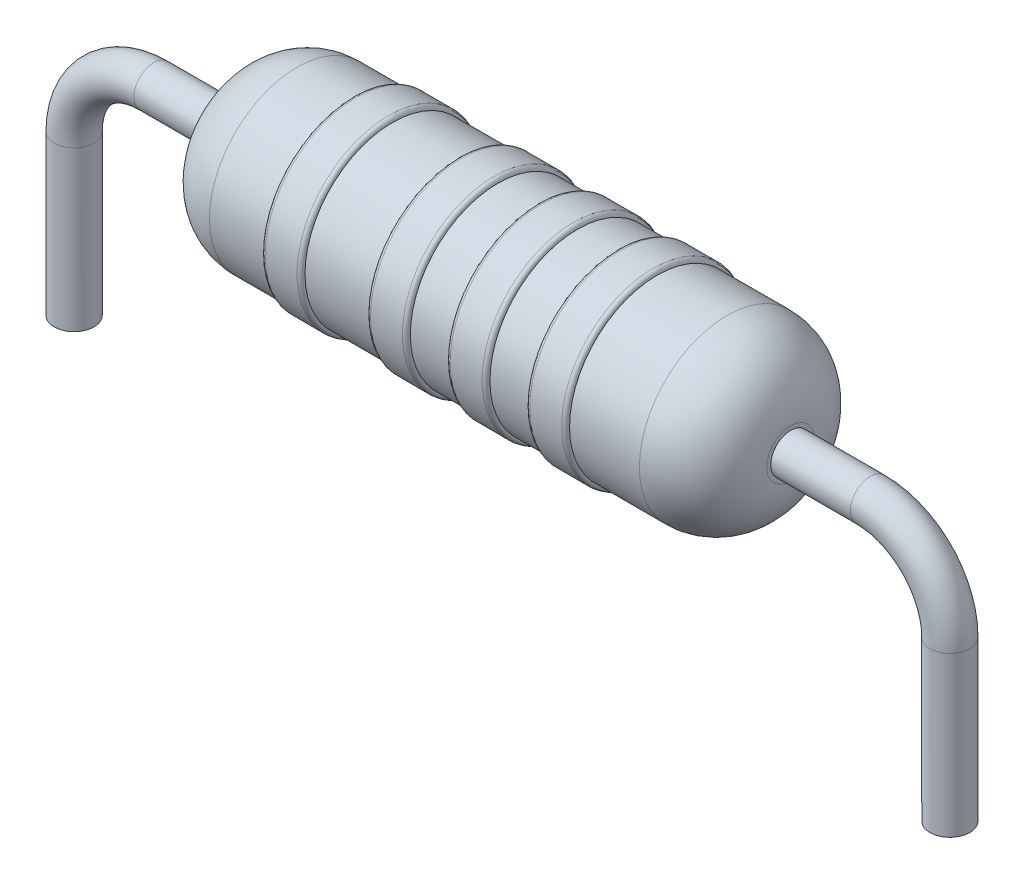
ISO-10303-21;
HEADER;
FILE_DESCRIPTION(('STEP AP214'),'2;1');
FILE_NAME('part.step','',(''),(''),'','','');
FILE_SCHEMA(('AUTOMOTIVE_DESIGN { 1 0 10303 214 1 1 1 1 }'));
ENDSEC;
DATA;
#1=APPLICATION_CONTEXT('core data for automotive mechanical design processes');
#2=APPLICATION_PROTOCOL_DEFINITION('international standard','automotive_design',2000,#1);
#3=PRODUCT_CONTEXT('',#1,'mechanical');
#4=PRODUCT('Part','Part','',(#3));
#5=PRODUCT_RELATED_PRODUCT_CATEGORY('part','',(#4));
#6=PRODUCT_DEFINITION_FORMATION('','',#4);
#7=PRODUCT_DEFINITION_CONTEXT('part definition',#1,'design');
#8=PRODUCT_DEFINITION('design','',#6,#7);
#9=PRODUCT_DEFINITION_SHAPE('','',#8);
#10=(LENGTH_UNIT() NAMED_UNIT(*) SI_UNIT(.MILLI.,.METRE.));
#11=(NAMED_UNIT(*) PLANE_ANGLE_UNIT() SI_UNIT($,.RADIAN.));
#12=(NAMED_UNIT(*) SI_UNIT($,.STERADIAN.) SOLID_ANGLE_UNIT());
#13=UNCERTAINTY_MEASURE_WITH_UNIT(LENGTH_MEASURE(1.E-05),#10,'distance_accuracy_value','');
#14=(GEOMETRIC_REPRESENTATION_CONTEXT(3) GLOBAL_UNCERTAINTY_ASSIGNED_CONTEXT((#13)) GLOBAL_UNIT_ASSIGNED_CONTEXT((#10,
#11,#12)) REPRESENTATION_CONTEXT('',''));
#15=CARTESIAN_POINT('',(0.,0.,0.));
#16=DIRECTION('',(0.,0.,1.));
#17=DIRECTION('',(1.,0.,0.));
#18=AXIS2_PLACEMENT_3D('',#15,#16,#17);
#19=CARTESIAN_POINT('',(-3.5,0.,0.));
#20=DIRECTION('',(1.,0.,0.));
#21=DIRECTION('',(0.,0.,-1.));
#22=AXIS2_PLACEMENT_3D('',#19,#20,#21);
#23=PLANE('',#22);
#24=CARTESIAN_POINT('',(-3.5,0.,0.));
#25=DIRECTION('',(-1.,0.,0.));
#26=DIRECTION('',(0.,0.,1.));
#27=AXIS2_PLACEMENT_3D('',#24,#25,#26);
#28=CIRCLE('',#27,0.299999999999995);
#29=CARTESIAN_POINT('',(-3.5,0.,0.299999999999995));
#30=VERTEX_POINT('',#29);
#31=EDGE_CURVE('E91',#30,#30,#28,.T.);
#32=ORIENTED_EDGE('',*,*,#31,.T.);
#33=EDGE_LOOP('',(#32));
#34=FACE_BOUND('',#33,.T.);
#35=CARTESIAN_POINT('',(-3.5,0.,0.));
#36=DIRECTION('',(1.,0.,0.));
#37=DIRECTION('',(0.,0.,-1.));
#38=AXIS2_PLACEMENT_3D('',#35,#36,#37);
#39=CIRCLE('',#38,0.25);
#40=CARTESIAN_POINT('',(-3.5,0.,-0.25));
#41=VERTEX_POINT('',#40);
#42=EDGE_CURVE('E10',#41,#41,#39,.F.);
#43=ORIENTED_EDGE('',*,*,#42,.F.);
#44=EDGE_LOOP('',(#43));
#45=FACE_BOUND('',#44,.T.);
#46=ADVANCED_FACE('F32',(#34,#45),#23,.F.);
#47=CARTESIAN_POINT('',(-54.2686615886834,0.,0.));
#48=DIRECTION('',(-1.,0.,0.));
#49=DIRECTION('',(0.,0.,1.));
#50=AXIS2_PLACEMENT_3D('',#47,#48,#49);
#51=CYLINDRICAL_SURFACE('',#50,1.1);
#52=CARTESIAN_POINT('',(0.322975145638588,0.,0.));
#53=DIRECTION('',(-1.,0.,0.));
#54=DIRECTION('',(0.,0.,1.));
#55=AXIS2_PLACEMENT_3D('',#52,#53,#54);
#56=CIRCLE('',#55,1.1);
#57=CARTESIAN_POINT('',(0.322975145638588,0.,1.1));
#58=VERTEX_POINT('',#57);
#59=EDGE_CURVE('E79',#58,#58,#56,.T.);
#60=ORIENTED_EDGE('',*,*,#59,.T.);
#61=EDGE_LOOP('',(#60));
#62=FACE_BOUND('',#61,.T.);
#63=CARTESIAN_POINT('',(-0.177024854361413,0.,0.));
#64=DIRECTION('',(1.,0.,0.));
#65=DIRECTION('',(0.,0.,-1.));
#66=AXIS2_PLACEMENT_3D('',#63,#64,#65);
#67=CIRCLE('',#66,1.1);
#68=CARTESIAN_POINT('',(-0.177024854361413,0.,-1.1));
#69=VERTEX_POINT('',#68);
#70=EDGE_CURVE('E88',#69,#69,#67,.T.);
#71=ORIENTED_EDGE('',*,*,#70,.T.);
#72=EDGE_LOOP('',(#71));
#73=FACE_BOUND('',#72,.T.);
#74=ADVANCED_FACE('F149',(#62,#73),#51,.T.);
#75=CARTESIAN_POINT('',(4.3261723446646,0.,0.));
#76=DIRECTION('',(1.,0.,0.));
#77=DIRECTION('',(0.,0.,-1.));
#78=AXIS2_PLACEMENT_3D('',#75,#76,#77);
#79=CYLINDRICAL_SURFACE('',#78,1.15);
#80=CARTESIAN_POINT('',(-0.627024854361413,0.,0.));
#81=DIRECTION('',(-1.,0.,0.));
#82=DIRECTION('',(0.,0.,1.));
#83=AXIS2_PLACEMENT_3D('',#80,#81,#82);
#84=CIRCLE('',#83,1.15);
#85=CARTESIAN_POINT('',(-0.627024854361413,0.,1.15));
#86=VERTEX_POINT('',#85);
#87=EDGE_CURVE('E55',#86,#86,#84,.F.);
#88=ORIENTED_EDGE('',*,*,#87,.T.);
#89=EDGE_LOOP('',(#88));
#90=FACE_BOUND('',#89,.T.);
#91=CARTESIAN_POINT('',(-0.227024854361413,0.,0.));
#92=DIRECTION('',(1.,0.,0.));
#93=DIRECTION('',(0.,0.,-1.));
#94=AXIS2_PLACEMENT_3D('',#91,#92,#93);
#95=CIRCLE('',#94,1.15);
#96=CARTESIAN_POINT('',(-0.227024854361413,0.,-1.15));
#97=VERTEX_POINT('',#96);
#98=EDGE_CURVE('E58',#97,#97,#95,.F.);
#99=ORIENTED_EDGE('',*,*,#98,.T.);
#100=EDGE_LOOP('',(#99));
#101=FACE_BOUND('',#100,.T.);
#102=ADVANCED_FACE('F155',(#90,#101),#79,.T.);
#103=CARTESIAN_POINT('',(-1.5,0.,0.));
#104=DIRECTION('',(1.,0.,0.));
#105=DIRECTION('',(0.,0.,-1.));
#106=AXIS2_PLACEMENT_3D('',#103,#104,#105);
#107=CIRCLE('',#106,1.1);
#108=CARTESIAN_POINT('',(-1.5,0.,-1.1));
#109=VERTEX_POINT('',#108);
#110=EDGE_CURVE('E72',#109,#109,#107,.T.);
#111=ORIENTED_EDGE('',*,*,#110,.T.);
#112=EDGE_LOOP('',(#111));
#113=FACE_BOUND('',#112,.T.);
#114=CARTESIAN_POINT('',(-0.677024854361413,0.,0.));
#115=DIRECTION('',(-1.,0.,0.));
#116=DIRECTION('',(0.,0.,1.));
#117=AXIS2_PLACEMENT_3D('',#114,#115,#116);
#118=CIRCLE('',#117,1.1);
#119=CARTESIAN_POINT('',(-0.677024854361413,0.,1.1));
#120=VERTEX_POINT('',#119);
#121=EDGE_CURVE('E85',#120,#120,#118,.T.);
#122=ORIENTED_EDGE('',*,*,#121,.T.);
#123=EDGE_LOOP('',(#122));
#124=FACE_BOUND('',#123,.T.);
#125=ADVANCED_FACE('F158',(#113,#124),#51,.T.);
#126=CARTESIAN_POINT('',(4.3261723446646,0.,0.));
#127=DIRECTION('',(1.,0.,0.));
#128=DIRECTION('',(0.,0.,-1.));
#129=AXIS2_PLACEMENT_3D('',#126,#127,#128);
#130=CYLINDRICAL_SURFACE('',#129,1.15);
#131=CARTESIAN_POINT('',(0.372975145638587,0.,0.));
#132=DIRECTION('',(-1.,0.,0.));
#133=DIRECTION('',(0.,0.,1.));
#134=AXIS2_PLACEMENT_3D('',#131,#132,#133);
#135=CIRCLE('',#134,1.15);
#136=CARTESIAN_POINT('',(0.372975145638587,0.,1.15));
#137=VERTEX_POINT('',#136);
#138=EDGE_CURVE('E47',#137,#137,#135,.F.);
#139=ORIENTED_EDGE('',*,*,#138,.T.);
#140=EDGE_LOOP('',(#139));
#141=FACE_BOUND('',#140,.T.);
#142=CARTESIAN_POINT('',(0.772975145638587,0.,0.));
#143=DIRECTION('',(1.,0.,0.));
#144=DIRECTION('',(0.,0.,-1.));
#145=AXIS2_PLACEMENT_3D('',#142,#143,#144);
#146=CIRCLE('',#145,1.15);
#147=CARTESIAN_POINT('',(0.772975145638587,0.,-1.15));
#148=VERTEX_POINT('',#147);
#149=EDGE_CURVE('E52',#148,#148,#146,.F.);
#150=ORIENTED_EDGE('',*,*,#149,.T.);
#151=EDGE_LOOP('',(#150));
#152=FACE_BOUND('',#151,.T.);
#153=ADVANCED_FACE('F171',(#141,#152),#130,.T.);
#154=CARTESIAN_POINT('',(1.32297514563859,0.,0.));
#155=DIRECTION('',(-1.,0.,0.));
#156=DIRECTION('',(0.,0.,1.));
#157=AXIS2_PLACEMENT_3D('',#154,#155,#156);
#158=CIRCLE('',#157,1.1);
#159=CARTESIAN_POINT('',(1.32297514563859,0.,1.1));
#160=VERTEX_POINT('',#159);
#161=EDGE_CURVE('E71',#160,#160,#158,.T.);
#162=ORIENTED_EDGE('',*,*,#161,.T.);
#163=EDGE_LOOP('',(#162));
#164=FACE_BOUND('',#163,.T.);
#165=CARTESIAN_POINT('',(0.822975145638588,0.,0.));
#166=DIRECTION('',(1.,0.,0.));
#167=DIRECTION('',(0.,0.,-1.));
#168=AXIS2_PLACEMENT_3D('',#165,#166,#167);
#169=CIRCLE('',#168,1.1);
#170=CARTESIAN_POINT('',(0.822975145638588,0.,-1.1));
#171=VERTEX_POINT('',#170);
#172=EDGE_CURVE('E82',#171,#171,#169,.T.);
#173=ORIENTED_EDGE('',*,*,#172,.T.);
#174=EDGE_LOOP('',(#173));
#175=FACE_BOUND('',#174,.T.);
#176=ADVANCED_FACE('F159',(#164,#175),#51,.T.);
#177=CARTESIAN_POINT('',(4.3261723446646,0.,0.));
#178=DIRECTION('',(1.,0.,0.));
#179=DIRECTION('',(0.,0.,-1.));
#180=AXIS2_PLACEMENT_3D('',#177,#178,#179);
#181=CYLINDRICAL_SURFACE('',#180,1.15);
#182=CARTESIAN_POINT('',(1.37297514563859,0.,0.));
#183=DIRECTION('',(-1.,0.,0.));
#184=DIRECTION('',(0.,0.,1.));
#185=AXIS2_PLACEMENT_3D('',#182,#183,#184);
#186=CIRCLE('',#185,1.15);
#187=CARTESIAN_POINT('',(1.37297514563859,0.,1.15));
#188=VERTEX_POINT('',#187);
#189=EDGE_CURVE('E39',#188,#188,#186,.F.);
#190=ORIENTED_EDGE('',*,*,#189,.T.);
#191=EDGE_LOOP('',(#190));
#192=FACE_BOUND('',#191,.T.);
#193=CARTESIAN_POINT('',(1.77297514563859,0.,0.));
#194=DIRECTION('',(1.,0.,0.));
#195=DIRECTION('',(0.,0.,-1.));
#196=AXIS2_PLACEMENT_3D('',#193,#194,#195);
#197=CIRCLE('',#196,1.15);
#198=CARTESIAN_POINT('',(1.77297514563859,0.,-1.15));
#199=VERTEX_POINT('',#198);
#200=EDGE_CURVE('E43',#199,#199,#197,.F.);
#201=ORIENTED_EDGE('',*,*,#200,.T.);
#202=EDGE_LOOP('',(#201));
#203=FACE_BOUND('',#202,.T.);
#204=ADVANCED_FACE('F181',(#192,#203),#181,.T.);
#205=CARTESIAN_POINT('',(3.5,0.299999999999995,0.));
#206=DIRECTION('',(-1.,0.,0.));
#207=DIRECTION('',(0.,0.,1.));
#208=AXIS2_PLACEMENT_3D('',#205,#206,#207);
#209=PLANE('',#208);
#210=CARTESIAN_POINT('',(3.5,0.,0.));
#211=DIRECTION('',(-1.,0.,0.));
#212=DIRECTION('',(0.,0.,1.));
#213=AXIS2_PLACEMENT_3D('',#210,#211,#212);
#214=CIRCLE('',#213,0.25);
#215=CARTESIAN_POINT('',(3.5,0.,0.25));
#216=VERTEX_POINT('',#215);
#217=EDGE_CURVE('E119',#216,#216,#214,.T.);
#218=ORIENTED_EDGE('',*,*,#217,.T.);
#219=EDGE_LOOP('',(#218));
#220=FACE_BOUND('',#219,.T.);
#221=CARTESIAN_POINT('',(3.5,0.,0.));
#222=DIRECTION('',(-1.,0.,0.));
#223=DIRECTION('',(0.,0.,1.));
#224=AXIS2_PLACEMENT_3D('',#221,#222,#223);
#225=CIRCLE('',#224,0.299999999999995);
#226=CARTESIAN_POINT('',(3.5,0.,0.299999999999995));
#227=VERTEX_POINT('',#226);
#228=EDGE_CURVE('E67',#227,#227,#225,.T.);
#229=ORIENTED_EDGE('',*,*,#228,.F.);
#230=EDGE_LOOP('',(#229));
#231=FACE_BOUND('',#230,.T.);
#232=ADVANCED_FACE('F177',(#220,#231),#209,.F.);
#233=CARTESIAN_POINT('',(2.7,0.,0.));
#234=DIRECTION('',(-1.,0.,0.));
#235=DIRECTION('',(0.,0.,1.));
#236=AXIS2_PLACEMENT_3D('',#233,#234,#235);
#237=DEGENERATE_TOROIDAL_SURFACE('',#236,0.3,0.8,.T.);
#238=CARTESIAN_POINT('',(2.69999999999999,0.,0.));
#239=DIRECTION('',(-1.,0.,0.));
#240=DIRECTION('',(0.,0.,1.));
#241=AXIS2_PLACEMENT_3D('',#238,#239,#240);
#242=CIRCLE('',#241,1.1);
#243=CARTESIAN_POINT('',(2.69999999999999,0.,1.1));
#244=VERTEX_POINT('',#243);
#245=EDGE_CURVE('E96',#244,#244,#242,.T.);
#246=ORIENTED_EDGE('',*,*,#245,.F.);
#247=EDGE_LOOP('',(#246));
#248=FACE_BOUND('',#247,.T.);
#249=ORIENTED_EDGE('',*,*,#228,.T.);
#250=EDGE_LOOP('',(#249));
#251=FACE_BOUND('',#250,.T.);
#252=ADVANCED_FACE('F173',(#248,#251),#237,.T.);
#253=CARTESIAN_POINT('',(1.82297514563859,0.,0.));
#254=DIRECTION('',(1.,0.,0.));
#255=DIRECTION('',(0.,0.,-1.));
#256=AXIS2_PLACEMENT_3D('',#253,#254,#255);
#257=CIRCLE('',#256,1.1);
#258=CARTESIAN_POINT('',(1.82297514563859,0.,-1.1));
#259=VERTEX_POINT('',#258);
#260=EDGE_CURVE('E76',#259,#259,#257,.T.);
#261=ORIENTED_EDGE('',*,*,#260,.T.);
#262=EDGE_LOOP('',(#261));
#263=FACE_BOUND('',#262,.T.);
#264=ORIENTED_EDGE('',*,*,#245,.T.);
#265=EDGE_LOOP('',(#264));
#266=FACE_BOUND('',#265,.T.);
#267=ADVANCED_FACE('F176',(#263,#266),#51,.T.);
#268=CARTESIAN_POINT('',(4.3261723446646,0.,0.));
#269=DIRECTION('',(1.,0.,0.));
#270=DIRECTION('',(0.,0.,-1.));
#271=AXIS2_PLACEMENT_3D('',#268,#269,#270);
#272=CYLINDRICAL_SURFACE('',#271,1.15);
#273=CARTESIAN_POINT('',(-1.95,0.,0.));
#274=DIRECTION('',(-1.,0.,0.));
#275=DIRECTION('',(0.,0.,1.));
#276=AXIS2_PLACEMENT_3D('',#273,#274,#275);
#277=CIRCLE('',#276,1.15);
#278=CARTESIAN_POINT('',(-1.95,0.,1.15));
#279=VERTEX_POINT('',#278);
#280=EDGE_CURVE('E61',#279,#279,#277,.F.);
#281=ORIENTED_EDGE('',*,*,#280,.T.);
#282=EDGE_LOOP('',(#281));
#283=FACE_BOUND('',#282,.T.);
#284=CARTESIAN_POINT('',(-1.55,0.,0.));
#285=DIRECTION('',(1.,0.,0.));
#286=DIRECTION('',(0.,0.,-1.));
#287=AXIS2_PLACEMENT_3D('',#284,#285,#286);
#288=CIRCLE('',#287,1.15);
#289=CARTESIAN_POINT('',(-1.55,0.,-1.15));
#290=VERTEX_POINT('',#289);
#291=EDGE_CURVE('E64',#290,#290,#288,.F.);
#292=ORIENTED_EDGE('',*,*,#291,.T.);
#293=EDGE_LOOP('',(#292));
#294=FACE_BOUND('',#293,.T.);
#295=ADVANCED_FACE('F167',(#283,#294),#272,.T.);
#296=CARTESIAN_POINT('',(-2.7,0.,0.));
#297=DIRECTION('',(-1.,0.,0.));
#298=DIRECTION('',(0.,0.,1.));
#299=AXIS2_PLACEMENT_3D('',#296,#297,#298);
#300=DEGENERATE_TOROIDAL_SURFACE('',#299,0.3,0.8,.T.);
#301=ORIENTED_EDGE('',*,*,#31,.F.);
#302=EDGE_LOOP('',(#301));
#303=FACE_BOUND('',#302,.T.);
#304=CARTESIAN_POINT('',(-2.69999999999999,0.,0.));
#305=DIRECTION('',(-1.,0.,0.));
#306=DIRECTION('',(0.,0.,1.));
#307=AXIS2_PLACEMENT_3D('',#304,#305,#306);
#308=CIRCLE('',#307,1.1);
#309=CARTESIAN_POINT('',(-2.69999999999999,0.,1.1));
#310=VERTEX_POINT('',#309);
#311=EDGE_CURVE('E99',#310,#310,#308,.T.);
#312=ORIENTED_EDGE('',*,*,#311,.T.);
#313=EDGE_LOOP('',(#312));
#314=FACE_BOUND('',#313,.T.);
#315=ADVANCED_FACE('F164',(#303,#314),#300,.T.);
#316=CARTESIAN_POINT('',(-2.,0.,0.));
#317=DIRECTION('',(-1.,0.,0.));
#318=DIRECTION('',(0.,0.,1.));
#319=AXIS2_PLACEMENT_3D('',#316,#317,#318);
#320=CIRCLE('',#319,1.1);
#321=CARTESIAN_POINT('',(-2.,0.,1.1));
#322=VERTEX_POINT('',#321);
#323=EDGE_CURVE('E68',#322,#322,#320,.T.);
#324=ORIENTED_EDGE('',*,*,#323,.T.);
#325=EDGE_LOOP('',(#324));
#326=FACE_BOUND('',#325,.T.);
#327=ORIENTED_EDGE('',*,*,#311,.F.);
#328=EDGE_LOOP('',(#327));
#329=FACE_BOUND('',#328,.T.);
#330=ADVANCED_FACE('F166',(#326,#329),#51,.T.);
#331=CARTESIAN_POINT('',(-1.95,0.,0.));
#332=DIRECTION('',(-1.,0.,0.));
#333=DIRECTION('',(0.,0.,1.));
#334=AXIS2_PLACEMENT_3D('',#331,#332,#333);
#335=TOROIDAL_SURFACE('',#334,1.1,0.05);
#336=ORIENTED_EDGE('',*,*,#323,.F.);
#337=EDGE_LOOP('',(#336));
#338=FACE_BOUND('',#337,.T.);
#339=ORIENTED_EDGE('',*,*,#280,.F.);
#340=EDGE_LOOP('',(#339));
#341=FACE_BOUND('',#340,.T.);
#342=ADVANCED_FACE('F183',(#338,#341),#335,.T.);
#343=CARTESIAN_POINT('',(-1.55,0.,0.));
#344=DIRECTION('',(1.,0.,0.));
#345=DIRECTION('',(0.,0.,-1.));
#346=AXIS2_PLACEMENT_3D('',#343,#344,#345);
#347=TOROIDAL_SURFACE('',#346,1.1,0.05);
#348=ORIENTED_EDGE('',*,*,#291,.F.);
#349=EDGE_LOOP('',(#348));
#350=FACE_BOUND('',#349,.T.);
#351=ORIENTED_EDGE('',*,*,#110,.F.);
#352=EDGE_LOOP('',(#351));
#353=FACE_BOUND('',#352,.T.);
#354=ADVANCED_FACE('F186',(#350,#353),#347,.T.);
#355=CARTESIAN_POINT('',(-0.627024854361413,0.,0.));
#356=DIRECTION('',(-1.,0.,0.));
#357=DIRECTION('',(0.,0.,1.));
#358=AXIS2_PLACEMENT_3D('',#355,#356,#357);
#359=TOROIDAL_SURFACE('',#358,1.1,0.05);
#360=ORIENTED_EDGE('',*,*,#121,.F.);
#361=EDGE_LOOP('',(#360));
#362=FACE_BOUND('',#361,.T.);
#363=ORIENTED_EDGE('',*,*,#87,.F.);
#364=EDGE_LOOP('',(#363));
#365=FACE_BOUND('',#364,.T.);
#366=ADVANCED_FACE('F190',(#362,#365),#359,.T.);
#367=CARTESIAN_POINT('',(-0.227024854361413,0.,0.));
#368=DIRECTION('',(1.,0.,0.));
#369=DIRECTION('',(0.,0.,-1.));
#370=AXIS2_PLACEMENT_3D('',#367,#368,#369);
#371=TOROIDAL_SURFACE('',#370,1.1,0.05);
#372=ORIENTED_EDGE('',*,*,#98,.F.);
#373=EDGE_LOOP('',(#372));
#374=FACE_BOUND('',#373,.T.);
#375=ORIENTED_EDGE('',*,*,#70,.F.);
#376=EDGE_LOOP('',(#375));
#377=FACE_BOUND('',#376,.T.);
#378=ADVANCED_FACE('F194',(#374,#377),#371,.T.);
#379=CARTESIAN_POINT('',(0.372975145638587,0.,0.));
#380=DIRECTION('',(-1.,0.,0.));
#381=DIRECTION('',(0.,0.,1.));
#382=AXIS2_PLACEMENT_3D('',#379,#380,#381);
#383=TOROIDAL_SURFACE('',#382,1.1,0.05);
#384=ORIENTED_EDGE('',*,*,#59,.F.);
#385=EDGE_LOOP('',(#384));
#386=FACE_BOUND('',#385,.T.);
#387=ORIENTED_EDGE('',*,*,#138,.F.);
#388=EDGE_LOOP('',(#387));
#389=FACE_BOUND('',#388,.T.);
#390=ADVANCED_FACE('F198',(#386,#389),#383,.T.);
#391=CARTESIAN_POINT('',(0.772975145638587,0.,0.));
#392=DIRECTION('',(1.,0.,0.));
#393=DIRECTION('',(0.,0.,-1.));
#394=AXIS2_PLACEMENT_3D('',#391,#392,#393);
#395=TOROIDAL_SURFACE('',#394,1.1,0.05);
#396=ORIENTED_EDGE('',*,*,#149,.F.);
#397=EDGE_LOOP('',(#396));
#398=FACE_BOUND('',#397,.T.);
#399=ORIENTED_EDGE('',*,*,#172,.F.);
#400=EDGE_LOOP('',(#399));
#401=FACE_BOUND('',#400,.T.);
#402=ADVANCED_FACE('F202',(#398,#401),#395,.T.);
#403=CARTESIAN_POINT('',(1.37297514563859,0.,0.));
#404=DIRECTION('',(-1.,0.,0.));
#405=DIRECTION('',(0.,0.,1.));
#406=AXIS2_PLACEMENT_3D('',#403,#404,#405);
#407=TOROIDAL_SURFACE('',#406,1.1,0.05);
#408=ORIENTED_EDGE('',*,*,#161,.F.);
#409=EDGE_LOOP('',(#408));
#410=FACE_BOUND('',#409,.T.);
#411=ORIENTED_EDGE('',*,*,#189,.F.);
#412=EDGE_LOOP('',(#411));
#413=FACE_BOUND('',#412,.T.);
#414=ADVANCED_FACE('F205',(#410,#413),#407,.T.);
#415=CARTESIAN_POINT('',(1.77297514563859,0.,0.));
#416=DIRECTION('',(1.,0.,0.));
#417=DIRECTION('',(0.,0.,-1.));
#418=AXIS2_PLACEMENT_3D('',#415,#416,#417);
#419=TOROIDAL_SURFACE('',#418,1.1,0.05);
#420=ORIENTED_EDGE('',*,*,#200,.F.);
#421=EDGE_LOOP('',(#420));
#422=FACE_BOUND('',#421,.T.);
#423=ORIENTED_EDGE('',*,*,#260,.F.);
#424=EDGE_LOOP('',(#423));
#425=FACE_BOUND('',#424,.T.);
#426=ADVANCED_FACE('F34',(#422,#425),#419,.T.);
#427=CARTESIAN_POINT('',(-5.5,-1.00000000000001,0.));
#428=DIRECTION('',(0.,-1.,0.));
#429=DIRECTION('',(0.,0.,-1.));
#430=AXIS2_PLACEMENT_3D('',#427,#428,#429);
#431=CYLINDRICAL_SURFACE('',#430,0.25);
#432=CARTESIAN_POINT('',(-5.5,-1.00000000000001,0.));
#433=DIRECTION('',(0.,-1.,0.));
#434=DIRECTION('',(0.,0.,1.));
#435=AXIS2_PLACEMENT_3D('',#432,#433,#434);
#436=CIRCLE('',#435,0.25);
#437=CARTESIAN_POINT('',(-5.75,-1.00000000000001,0.));
#438=VERTEX_POINT('',#437);
#439=EDGE_CURVE('E106',#438,#438,#436,.T.);
#440=ORIENTED_EDGE('',*,*,#439,.T.);
#441=EDGE_LOOP('',(#440));
#442=FACE_BOUND('',#441,.T.);
#443=CARTESIAN_POINT('',(-5.5,-3.,0.));
#444=DIRECTION('',(0.,-1.,0.));
#445=DIRECTION('',(0.,0.,1.));
#446=AXIS2_PLACEMENT_3D('',#443,#444,#445);
#447=CIRCLE('',#446,0.25);
#448=CARTESIAN_POINT('',(-5.5,-3.,0.25));
#449=VERTEX_POINT('',#448);
#450=EDGE_CURVE('E75',#449,#449,#447,.T.);
#451=ORIENTED_EDGE('',*,*,#450,.F.);
#452=EDGE_LOOP('',(#451));
#453=FACE_BOUND('',#452,.T.);
#454=ADVANCED_FACE('F212',(#442,#453),#431,.T.);
#455=CARTESIAN_POINT('',(-4.5,-1.,0.));
#456=DIRECTION('',(0.,0.,1.));
#457=DIRECTION('',(1.,0.,0.));
#458=AXIS2_PLACEMENT_3D('',#455,#456,#457);
#459=TOROIDAL_SURFACE('',#458,1.,0.25);
#460=CARTESIAN_POINT('',(-4.49999999999999,0.,0.));
#461=DIRECTION('',(-1.,0.,0.));
#462=DIRECTION('',(0.,0.,1.));
#463=AXIS2_PLACEMENT_3D('',#460,#461,#462);
#464=CIRCLE('',#463,0.25);
#465=CARTESIAN_POINT('',(-4.49999999999999,0.25,0.));
#466=VERTEX_POINT('',#465);
#467=EDGE_CURVE('E109',#466,#466,#464,.T.);
#468=CARTESIAN_POINT('',(-4.5,-1.,0.));
#469=DIRECTION('',(0.,0.,1.));
#470=DIRECTION('',(1.,0.,0.));
#471=AXIS2_PLACEMENT_3D('',#468,#469,#470);
#472=CIRCLE('',#471,1.25);
#473=EDGE_CURVE('',#466,#438,#472,.T.);
#474=ORIENTED_EDGE('',*,*,#467,.T.);
#475=ORIENTED_EDGE('',*,*,#439,.F.);
#476=ORIENTED_EDGE('',*,*,#473,.T.);
#477=ORIENTED_EDGE('',*,*,#473,.F.);
#478=EDGE_LOOP('',(#474,#476,#475,#477));
#479=FACE_BOUND('',#478,.T.);
#480=ADVANCED_FACE('F353',(#479),#459,.T.);
#481=CARTESIAN_POINT('',(-4.49999999999999,0.,0.));
#482=DIRECTION('',(1.,0.,0.));
#483=DIRECTION('',(0.,0.,-1.));
#484=AXIS2_PLACEMENT_3D('',#481,#482,#483);
#485=CYLINDRICAL_SURFACE('',#484,0.25);
#486=ORIENTED_EDGE('',*,*,#467,.F.);
#487=EDGE_LOOP('',(#486));
#488=FACE_BOUND('',#487,.T.);
#489=ORIENTED_EDGE('',*,*,#42,.T.);
#490=EDGE_LOOP('',(#489));
#491=FACE_BOUND('',#490,.T.);
#492=ADVANCED_FACE('F364',(#488,#491),#485,.T.);
#493=CARTESIAN_POINT('',(-5.5,-3.,0.));
#494=DIRECTION('',(0.,-1.,0.));
#495=DIRECTION('',(0.,0.,1.));
#496=AXIS2_PLACEMENT_3D('',#493,#494,#495);
#497=PLANE('',#496);
#498=ORIENTED_EDGE('',*,*,#450,.T.);
#499=EDGE_LOOP('',(#498));
#500=FACE_BOUND('',#499,.T.);
#501=ADVANCED_FACE('F137',(#500),#497,.T.);
#502=CARTESIAN_POINT('',(5.5,-1.00000000000001,0.));
#503=DIRECTION('',(0.,-1.,0.));
#504=DIRECTION('',(0.,0.,-1.));
#505=AXIS2_PLACEMENT_3D('',#502,#503,#504);
#506=CYLINDRICAL_SURFACE('',#505,0.25);
#507=CARTESIAN_POINT('',(5.5,-1.00000000000001,0.));
#508=DIRECTION('',(0.,1.,0.));
#509=DIRECTION('',(0.,0.,1.));
#510=AXIS2_PLACEMENT_3D('',#507,#508,#509);
#511=CIRCLE('',#510,0.25);
#512=CARTESIAN_POINT('',(5.75,-1.00000000000001,0.));
#513=VERTEX_POINT('',#512);
#514=EDGE_CURVE('E115',#513,#513,#511,.T.);
#515=ORIENTED_EDGE('',*,*,#514,.F.);
#516=EDGE_LOOP('',(#515));
#517=FACE_BOUND('',#516,.T.);
#518=CARTESIAN_POINT('',(5.5,-3.,0.));
#519=DIRECTION('',(0.,1.,0.));
#520=DIRECTION('',(0.,0.,1.));
#521=AXIS2_PLACEMENT_3D('',#518,#519,#520);
#522=CIRCLE('',#521,0.25);
#523=CARTESIAN_POINT('',(5.5,-3.,0.25));
#524=VERTEX_POINT('',#523);
#525=EDGE_CURVE('E112',#524,#524,#522,.T.);
#526=ORIENTED_EDGE('',*,*,#525,.T.);
#527=EDGE_LOOP('',(#526));
#528=FACE_BOUND('',#527,.T.);
#529=ADVANCED_FACE('F131',(#517,#528),#506,.T.);
#530=CARTESIAN_POINT('',(4.5,-1.,0.));
#531=DIRECTION('',(0.,0.,-1.));
#532=DIRECTION('',(-1.,0.,0.));
#533=AXIS2_PLACEMENT_3D('',#530,#531,#532);
#534=TOROIDAL_SURFACE('',#533,1.,0.25);
#535=CARTESIAN_POINT('',(4.49999999999999,0.,0.));
#536=DIRECTION('',(-1.,0.,0.));
#537=DIRECTION('',(0.,0.,1.));
#538=AXIS2_PLACEMENT_3D('',#535,#536,#537);
#539=CIRCLE('',#538,0.25);
#540=CARTESIAN_POINT('',(4.49999999999999,0.25,0.));
#541=VERTEX_POINT('',#540);
#542=EDGE_CURVE('E118',#541,#541,#539,.T.);
#543=CARTESIAN_POINT('',(4.5,-1.,0.));
#544=DIRECTION('',(0.,0.,-1.));
#545=DIRECTION('',(-1.,0.,0.));
#546=AXIS2_PLACEMENT_3D('',#543,#544,#545);
#547=CIRCLE('',#546,1.25);
#548=EDGE_CURVE('',#541,#513,#547,.T.);
#549=ORIENTED_EDGE('',*,*,#542,.F.);
#550=ORIENTED_EDGE('',*,*,#514,.T.);
#551=ORIENTED_EDGE('',*,*,#548,.T.);
#552=ORIENTED_EDGE('',*,*,#548,.F.);
#553=EDGE_LOOP('',(#549,#551,#550,#552));
#554=FACE_BOUND('',#553,.T.);
#555=ADVANCED_FACE('F128',(#554),#534,.T.);
#556=CARTESIAN_POINT('',(4.49999999999999,0.,0.));
#557=DIRECTION('',(-1.,0.,0.));
#558=DIRECTION('',(0.,0.,1.));
#559=AXIS2_PLACEMENT_3D('',#556,#557,#558);
#560=CYLINDRICAL_SURFACE('',#559,0.25);
#561=ORIENTED_EDGE('',*,*,#542,.T.);
#562=EDGE_LOOP('',(#561));
#563=FACE_BOUND('',#562,.T.);
#564=ORIENTED_EDGE('',*,*,#217,.F.);
#565=EDGE_LOOP('',(#564));
#566=FACE_BOUND('',#565,.T.);
#567=ADVANCED_FACE('F125',(#563,#566),#560,.T.);
#568=CARTESIAN_POINT('',(5.5,-3.,0.));
#569=DIRECTION('',(0.,-1.,0.));
#570=DIRECTION('',(0.,0.,1.));
#571=AXIS2_PLACEMENT_3D('',#568,#569,#570);
#572=PLANE('',#571);
#573=ORIENTED_EDGE('',*,*,#525,.F.);
#574=EDGE_LOOP('',(#573));
#575=FACE_BOUND('',#574,.T.);
#576=ADVANCED_FACE('F141',(#575),#572,.T.);
#577=CLOSED_SHELL('',(#46,#74,#102,#125,#153,#176,#204,#232,#252,#267,#295,#315,#330,#342,#354,
#366,#378,#390,#402,#414,#426,#454,#480,#492,#501,#529,#555,#567,#576));
#578=MANIFOLD_SOLID_BREP('B2',#577);
#579=ADVANCED_BREP_SHAPE_REPRESENTATION('',(#18,#578),#14);
#580=SHAPE_DEFINITION_REPRESENTATION(#9,#579);
ENDSEC;
END-ISO-10303-21;
